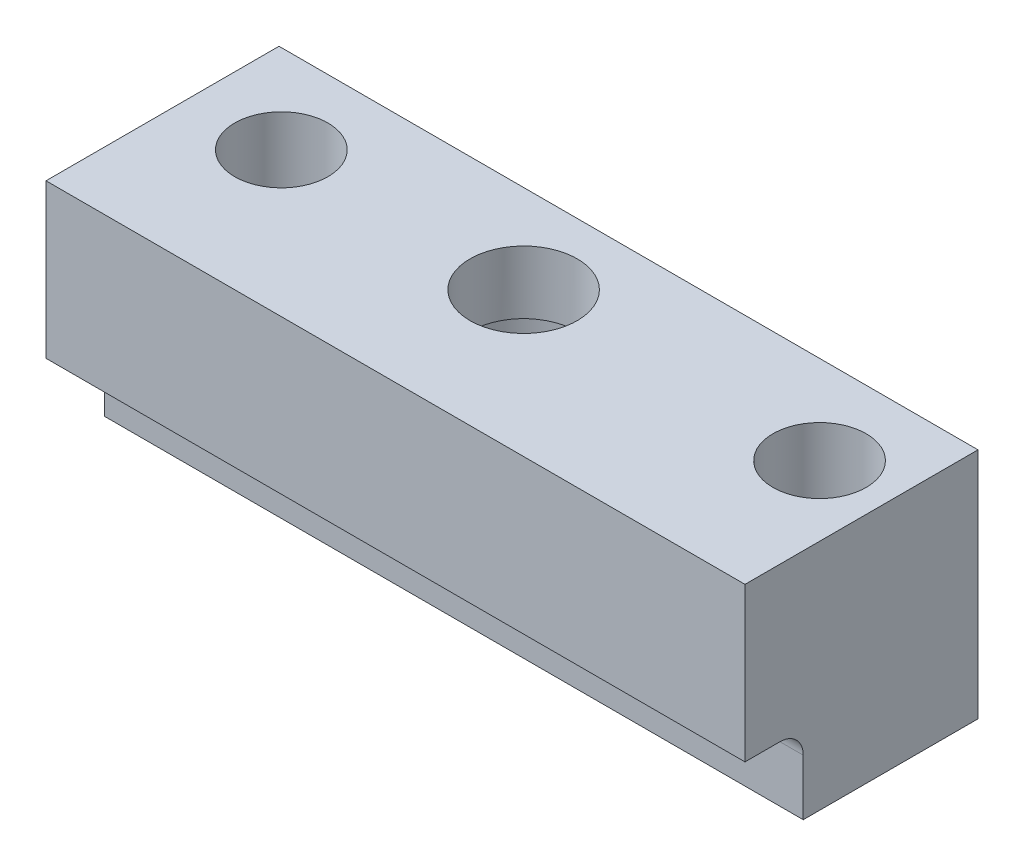
ISO-10303-21;
HEADER;
FILE_DESCRIPTION(('STEP AP214'),'2;1');
FILE_NAME('part.step','',(''),(''),'','','');
FILE_SCHEMA(('AUTOMOTIVE_DESIGN { 1 0 10303 214 1 1 1 1 }'));
ENDSEC;
DATA;
#1=APPLICATION_CONTEXT('core data for automotive mechanical design processes');
#2=APPLICATION_PROTOCOL_DEFINITION('international standard','automotive_design',2000,#1);
#3=PRODUCT_CONTEXT('',#1,'mechanical');
#4=PRODUCT('Part','Part','',(#3));
#5=PRODUCT_RELATED_PRODUCT_CATEGORY('part','',(#4));
#6=PRODUCT_DEFINITION_FORMATION('','',#4);
#7=PRODUCT_DEFINITION_CONTEXT('part definition',#1,'design');
#8=PRODUCT_DEFINITION('design','',#6,#7);
#9=PRODUCT_DEFINITION_SHAPE('','',#8);
#10=(LENGTH_UNIT() NAMED_UNIT(*) SI_UNIT(.MILLI.,.METRE.));
#11=(NAMED_UNIT(*) PLANE_ANGLE_UNIT() SI_UNIT($,.RADIAN.));
#12=(NAMED_UNIT(*) SI_UNIT($,.STERADIAN.) SOLID_ANGLE_UNIT());
#13=UNCERTAINTY_MEASURE_WITH_UNIT(LENGTH_MEASURE(1.E-05),#10,'distance_accuracy_value','');
#14=(GEOMETRIC_REPRESENTATION_CONTEXT(3) GLOBAL_UNCERTAINTY_ASSIGNED_CONTEXT((#13)) GLOBAL_UNIT_ASSIGNED_CONTEXT((#10,
#11,#12)) REPRESENTATION_CONTEXT('',''));
#15=CARTESIAN_POINT('',(0.,0.,0.));
#16=DIRECTION('',(0.,0.,1.));
#17=DIRECTION('',(1.,0.,0.));
#18=AXIS2_PLACEMENT_3D('',#15,#16,#17);
#19=CARTESIAN_POINT('',(0.,-8.636,-9.398));
#20=DIRECTION('',(0.,1.,0.));
#21=DIRECTION('',(0.,0.,1.));
#22=AXIS2_PLACEMENT_3D('',#19,#20,#21);
#23=CYLINDRICAL_SURFACE('',#22,5.842);
#24=CARTESIAN_POINT('',(0.,16.764,-9.398));
#25=DIRECTION('',(0.,1.,0.));
#26=DIRECTION('',(0.,0.,1.));
#27=AXIS2_PLACEMENT_3D('',#24,#25,#26);
#28=CIRCLE('',#27,5.842);
#29=CARTESIAN_POINT('',(0.,16.764,-3.556));
#30=VERTEX_POINT('',#29);
#31=EDGE_CURVE('E217',#30,#30,#28,.T.);
#32=ORIENTED_EDGE('',*,*,#31,.T.);
#33=EDGE_LOOP('',(#32));
#34=FACE_BOUND('',#33,.T.);
#35=CARTESIAN_POINT('',(0.,9.906,-9.398));
#36=DIRECTION('',(0.,-1.,0.));
#37=DIRECTION('',(0.,0.,-1.));
#38=AXIS2_PLACEMENT_3D('',#35,#36,#37);
#39=CIRCLE('',#38,5.842);
#40=CARTESIAN_POINT('',(0.,9.906,-15.24));
#41=VERTEX_POINT('',#40);
#42=EDGE_CURVE('E37',#41,#41,#39,.F.);
#43=ORIENTED_EDGE('',*,*,#42,.F.);
#44=EDGE_LOOP('',(#43));
#45=FACE_BOUND('',#44,.T.);
#46=ADVANCED_FACE('F33',(#34,#45),#23,.F.);
#47=CARTESIAN_POINT('',(-36.322,-8.636,0.));
#48=DIRECTION('',(0.,0.,1.));
#49=DIRECTION('',(1.,0.,0.));
#50=AXIS2_PLACEMENT_3D('',#47,#48,#49);
#51=PLANE('',#50);
#52=DIRECTION('',(0.,-1.,0.));
#53=VECTOR('',#52,1.);
#54=CARTESIAN_POINT('',(39.878,-8.636,0.));
#55=LINE('',#54,#53);
#56=CARTESIAN_POINT('',(39.878,-2.54,0.));
#57=VERTEX_POINT('',#56);
#58=CARTESIAN_POINT('',(39.878,-8.636,0.));
#59=VERTEX_POINT('',#58);
#60=EDGE_CURVE('E89',#57,#59,#55,.T.);
#61=ORIENTED_EDGE('',*,*,#60,.F.);
#62=DIRECTION('',(1.,0.,0.));
#63=VECTOR('',#62,1.);
#64=CARTESIAN_POINT('',(-36.322,-2.54,0.));
#65=LINE('',#64,#63);
#66=CARTESIAN_POINT('',(-36.322,-2.54,0.));
#67=VERTEX_POINT('',#66);
#68=EDGE_CURVE('E49',#57,#67,#65,.F.);
#69=ORIENTED_EDGE('',*,*,#68,.T.);
#70=DIRECTION('',(0.,-1.,0.));
#71=VECTOR('',#70,1.);
#72=CARTESIAN_POINT('',(-36.322,-8.636,0.));
#73=LINE('',#72,#71);
#74=CARTESIAN_POINT('',(-36.322,-8.636,0.));
#75=VERTEX_POINT('',#74);
#76=EDGE_CURVE('E101',#67,#75,#73,.T.);
#77=ORIENTED_EDGE('',*,*,#76,.T.);
#78=DIRECTION('',(1.,0.,0.));
#79=VECTOR('',#78,1.);
#80=CARTESIAN_POINT('',(-36.322,-8.636,0.));
#81=LINE('',#80,#79);
#82=EDGE_CURVE('E99',#75,#59,#81,.T.);
#83=ORIENTED_EDGE('',*,*,#82,.T.);
#84=EDGE_LOOP('',(#61,#69,#77,#83));
#85=FACE_BOUND('',#84,.T.);
#86=ADVANCED_FACE('F100',(#85),#51,.T.);
#87=CARTESIAN_POINT('',(-36.322,0.,0.));
#88=DIRECTION('',(0.,-1.,0.));
#89=DIRECTION('',(0.,0.,-1.));
#90=AXIS2_PLACEMENT_3D('',#87,#88,#89);
#91=PLANE('',#90);
#92=DIRECTION('',(0.,0.,-1.));
#93=VECTOR('',#92,1.);
#94=CARTESIAN_POINT('',(-36.322,0.,0.));
#95=LINE('',#94,#93);
#96=CARTESIAN_POINT('',(-36.322,0.,6.35));
#97=VERTEX_POINT('',#96);
#98=CARTESIAN_POINT('',(-36.322,0.,2.54));
#99=VERTEX_POINT('',#98);
#100=EDGE_CURVE('E106',#97,#99,#95,.T.);
#101=ORIENTED_EDGE('',*,*,#100,.T.);
#102=DIRECTION('',(1.,0.,0.));
#103=VECTOR('',#102,1.);
#104=CARTESIAN_POINT('',(39.878,0.,2.54));
#105=LINE('',#104,#103);
#106=CARTESIAN_POINT('',(39.878,0.,2.54));
#107=VERTEX_POINT('',#106);
#108=EDGE_CURVE('E138',#99,#107,#105,.T.);
#109=ORIENTED_EDGE('',*,*,#108,.T.);
#110=DIRECTION('',(0.,0.,-1.));
#111=VECTOR('',#110,1.);
#112=CARTESIAN_POINT('',(39.878,0.,0.));
#113=LINE('',#112,#111);
#114=CARTESIAN_POINT('',(39.878,0.,6.35));
#115=VERTEX_POINT('',#114);
#116=EDGE_CURVE('E120',#115,#107,#113,.T.);
#117=ORIENTED_EDGE('',*,*,#116,.F.);
#118=DIRECTION('',(1.,0.,0.));
#119=VECTOR('',#118,1.);
#120=CARTESIAN_POINT('',(-36.322,0.,6.35));
#121=LINE('',#120,#119);
#122=EDGE_CURVE('E136',#97,#115,#121,.T.);
#123=ORIENTED_EDGE('',*,*,#122,.F.);
#124=EDGE_LOOP('',(#101,#109,#117,#123));
#125=FACE_BOUND('',#124,.T.);
#126=ADVANCED_FACE('F150',(#125),#91,.T.);
#127=CARTESIAN_POINT('',(-36.322,0.,6.35));
#128=DIRECTION('',(0.,0.,1.));
#129=DIRECTION('',(1.,0.,0.));
#130=AXIS2_PLACEMENT_3D('',#127,#128,#129);
#131=PLANE('',#130);
#132=ORIENTED_EDGE('',*,*,#122,.T.);
#133=DIRECTION('',(0.,-1.,0.));
#134=VECTOR('',#133,1.);
#135=CARTESIAN_POINT('',(39.878,0.,6.35));
#136=LINE('',#135,#134);
#137=CARTESIAN_POINT('',(39.878,16.764,6.35));
#138=VERTEX_POINT('',#137);
#139=EDGE_CURVE('E117',#138,#115,#136,.T.);
#140=ORIENTED_EDGE('',*,*,#139,.F.);
#141=DIRECTION('',(1.,0.,0.));
#142=VECTOR('',#141,1.);
#143=CARTESIAN_POINT('',(-36.322,16.764,6.35));
#144=LINE('',#143,#142);
#145=CARTESIAN_POINT('',(-36.322,16.764,6.35));
#146=VERTEX_POINT('',#145);
#147=EDGE_CURVE('E139',#146,#138,#144,.T.);
#148=ORIENTED_EDGE('',*,*,#147,.F.);
#149=DIRECTION('',(0.,-1.,0.));
#150=VECTOR('',#149,1.);
#151=CARTESIAN_POINT('',(-36.322,0.,6.35));
#152=LINE('',#151,#150);
#153=EDGE_CURVE('E131',#146,#97,#152,.T.);
#154=ORIENTED_EDGE('',*,*,#153,.T.);
#155=EDGE_LOOP('',(#132,#140,#148,#154));
#156=FACE_BOUND('',#155,.T.);
#157=ADVANCED_FACE('F157',(#156),#131,.T.);
#158=CARTESIAN_POINT('',(-36.322,16.764,6.35));
#159=DIRECTION('',(0.,1.,0.));
#160=DIRECTION('',(0.,0.,1.));
#161=AXIS2_PLACEMENT_3D('',#158,#159,#160);
#162=PLANE('',#161);
#163=CARTESIAN_POINT('',(32.258,16.764,-9.398));
#164=DIRECTION('',(0.,1.,0.));
#165=DIRECTION('',(0.,0.,1.));
#166=AXIS2_PLACEMENT_3D('',#163,#164,#165);
#167=CIRCLE('',#166,5.08000000000001);
#168=CARTESIAN_POINT('',(32.258,16.764,-4.31799999999999));
#169=VERTEX_POINT('',#168);
#170=EDGE_CURVE('E219',#169,#169,#167,.T.);
#171=ORIENTED_EDGE('',*,*,#170,.F.);
#172=EDGE_LOOP('',(#171));
#173=FACE_BOUND('',#172,.T.);
#174=ORIENTED_EDGE('',*,*,#31,.F.);
#175=EDGE_LOOP('',(#174));
#176=FACE_BOUND('',#175,.T.);
#177=CARTESIAN_POINT('',(-26.416,16.764,-9.398));
#178=DIRECTION('',(0.,1.,0.));
#179=DIRECTION('',(0.,0.,1.));
#180=AXIS2_PLACEMENT_3D('',#177,#178,#179);
#181=CIRCLE('',#180,5.08);
#182=CARTESIAN_POINT('',(-26.416,16.764,-4.318));
#183=VERTEX_POINT('',#182);
#184=EDGE_CURVE('E213',#183,#183,#181,.T.);
#185=ORIENTED_EDGE('',*,*,#184,.F.);
#186=EDGE_LOOP('',(#185));
#187=FACE_BOUND('',#186,.T.);
#188=ORIENTED_EDGE('',*,*,#147,.T.);
#189=DIRECTION('',(0.,0.,1.));
#190=VECTOR('',#189,1.);
#191=CARTESIAN_POINT('',(39.878,16.764,6.35));
#192=LINE('',#191,#190);
#193=CARTESIAN_POINT('',(39.878,16.764,-19.05));
#194=VERTEX_POINT('',#193);
#195=EDGE_CURVE('E111',#194,#138,#192,.T.);
#196=ORIENTED_EDGE('',*,*,#195,.F.);
#197=DIRECTION('',(1.,0.,0.));
#198=VECTOR('',#197,1.);
#199=CARTESIAN_POINT('',(-36.322,16.764,-19.05));
#200=LINE('',#199,#198);
#201=CARTESIAN_POINT('',(-36.322,16.764,-19.05));
#202=VERTEX_POINT('',#201);
#203=EDGE_CURVE('E141',#202,#194,#200,.T.);
#204=ORIENTED_EDGE('',*,*,#203,.F.);
#205=DIRECTION('',(0.,0.,1.));
#206=VECTOR('',#205,1.);
#207=CARTESIAN_POINT('',(-36.322,16.764,6.35));
#208=LINE('',#207,#206);
#209=EDGE_CURVE('E128',#202,#146,#208,.T.);
#210=ORIENTED_EDGE('',*,*,#209,.T.);
#211=EDGE_LOOP('',(#188,#196,#204,#210));
#212=FACE_BOUND('',#211,.T.);
#213=ADVANCED_FACE('F191',(#173,#176,#187,#212),#162,.T.);
#214=CARTESIAN_POINT('',(-36.322,16.764,-19.05));
#215=DIRECTION('',(0.,0.,-1.));
#216=DIRECTION('',(0.,1.,0.));
#217=AXIS2_PLACEMENT_3D('',#214,#215,#216);
#218=PLANE('',#217);
#219=ORIENTED_EDGE('',*,*,#203,.T.);
#220=DIRECTION('',(0.,1.,0.));
#221=VECTOR('',#220,1.);
#222=CARTESIAN_POINT('',(39.878,16.764,-19.05));
#223=LINE('',#222,#221);
#224=CARTESIAN_POINT('',(39.878,-8.636,-19.05));
#225=VERTEX_POINT('',#224);
#226=EDGE_CURVE('E109',#225,#194,#223,.T.);
#227=ORIENTED_EDGE('',*,*,#226,.F.);
#228=DIRECTION('',(1.,0.,0.));
#229=VECTOR('',#228,1.);
#230=CARTESIAN_POINT('',(-36.322,-8.636,-19.05));
#231=LINE('',#230,#229);
#232=CARTESIAN_POINT('',(-36.322,-8.636,-19.05));
#233=VERTEX_POINT('',#232);
#234=EDGE_CURVE('E105',#233,#225,#231,.T.);
#235=ORIENTED_EDGE('',*,*,#234,.F.);
#236=DIRECTION('',(0.,1.,0.));
#237=VECTOR('',#236,1.);
#238=CARTESIAN_POINT('',(-36.322,16.764,-19.05));
#239=LINE('',#238,#237);
#240=EDGE_CURVE('E125',#233,#202,#239,.T.);
#241=ORIENTED_EDGE('',*,*,#240,.T.);
#242=EDGE_LOOP('',(#219,#227,#235,#241));
#243=FACE_BOUND('',#242,.T.);
#244=ADVANCED_FACE('F194',(#243),#218,.T.);
#245=CARTESIAN_POINT('',(-36.322,-8.636,-19.05));
#246=DIRECTION('',(0.,-1.,0.));
#247=DIRECTION('',(0.,0.,-1.));
#248=AXIS2_PLACEMENT_3D('',#245,#246,#247);
#249=PLANE('',#248);
#250=CARTESIAN_POINT('',(0.,-8.636,-9.398));
#251=DIRECTION('',(0.,-1.,0.));
#252=DIRECTION('',(0.,0.,-1.));
#253=AXIS2_PLACEMENT_3D('',#250,#251,#252);
#254=CIRCLE('',#253,7.366);
#255=CARTESIAN_POINT('',(0.,-8.636,-16.764));
#256=VERTEX_POINT('',#255);
#257=EDGE_CURVE('E206',#256,#256,#254,.T.);
#258=ORIENTED_EDGE('',*,*,#257,.F.);
#259=EDGE_LOOP('',(#258));
#260=FACE_BOUND('',#259,.T.);
#261=CARTESIAN_POINT('',(32.258,-8.636,-9.398));
#262=DIRECTION('',(0.,1.,0.));
#263=DIRECTION('',(0.,0.,1.));
#264=AXIS2_PLACEMENT_3D('',#261,#262,#263);
#265=CIRCLE('',#264,5.08000000000001);
#266=CARTESIAN_POINT('',(32.258,-8.636,-4.31799999999999));
#267=VERTEX_POINT('',#266);
#268=EDGE_CURVE('E210',#267,#267,#265,.T.);
#269=ORIENTED_EDGE('',*,*,#268,.T.);
#270=EDGE_LOOP('',(#269));
#271=FACE_BOUND('',#270,.T.);
#272=CARTESIAN_POINT('',(-26.416,-8.636,-9.398));
#273=DIRECTION('',(0.,1.,0.));
#274=DIRECTION('',(0.,0.,1.));
#275=AXIS2_PLACEMENT_3D('',#272,#273,#274);
#276=CIRCLE('',#275,5.08);
#277=CARTESIAN_POINT('',(-26.416,-8.636,-4.318));
#278=VERTEX_POINT('',#277);
#279=EDGE_CURVE('E96',#278,#278,#276,.T.);
#280=ORIENTED_EDGE('',*,*,#279,.T.);
#281=EDGE_LOOP('',(#280));
#282=FACE_BOUND('',#281,.T.);
#283=ORIENTED_EDGE('',*,*,#234,.T.);
#284=DIRECTION('',(0.,0.,-1.));
#285=VECTOR('',#284,1.);
#286=CARTESIAN_POINT('',(39.878,-8.636,-19.05));
#287=LINE('',#286,#285);
#288=EDGE_CURVE('E94',#59,#225,#287,.T.);
#289=ORIENTED_EDGE('',*,*,#288,.F.);
#290=ORIENTED_EDGE('',*,*,#82,.F.);
#291=DIRECTION('',(0.,0.,-1.));
#292=VECTOR('',#291,1.);
#293=CARTESIAN_POINT('',(-36.322,-8.636,-19.05));
#294=LINE('',#293,#292);
#295=EDGE_CURVE('E123',#75,#233,#294,.T.);
#296=ORIENTED_EDGE('',*,*,#295,.T.);
#297=EDGE_LOOP('',(#283,#289,#290,#296));
#298=FACE_BOUND('',#297,.T.);
#299=ADVANCED_FACE('F108',(#260,#271,#282,#298),#249,.T.);
#300=CARTESIAN_POINT('',(-36.322,0.,0.));
#301=DIRECTION('',(1.,0.,0.));
#302=DIRECTION('',(0.,0.,-1.));
#303=AXIS2_PLACEMENT_3D('',#300,#301,#302);
#304=PLANE('',#303);
#305=ORIENTED_EDGE('',*,*,#76,.F.);
#306=CARTESIAN_POINT('',(-36.322,-2.54,2.54));
#307=DIRECTION('',(1.,0.,0.));
#308=DIRECTION('',(0.,0.,-1.));
#309=AXIS2_PLACEMENT_3D('',#306,#307,#308);
#310=CIRCLE('',#309,2.54);
#311=EDGE_CURVE('E11',#67,#99,#310,.T.);
#312=ORIENTED_EDGE('',*,*,#311,.T.);
#313=ORIENTED_EDGE('',*,*,#100,.F.);
#314=ORIENTED_EDGE('',*,*,#153,.F.);
#315=ORIENTED_EDGE('',*,*,#209,.F.);
#316=ORIENTED_EDGE('',*,*,#240,.F.);
#317=ORIENTED_EDGE('',*,*,#295,.F.);
#318=EDGE_LOOP('',(#305,#312,#313,#314,#315,#316,#317));
#319=FACE_BOUND('',#318,.T.);
#320=ADVANCED_FACE('F161',(#319),#304,.F.);
#321=CARTESIAN_POINT('',(39.878,0.,0.));
#322=DIRECTION('',(1.,0.,0.));
#323=DIRECTION('',(0.,0.,-1.));
#324=AXIS2_PLACEMENT_3D('',#321,#322,#323);
#325=PLANE('',#324);
#326=ORIENTED_EDGE('',*,*,#116,.T.);
#327=CARTESIAN_POINT('',(39.878,-2.54,2.54));
#328=DIRECTION('',(1.,0.,0.));
#329=DIRECTION('',(0.,0.,-1.));
#330=AXIS2_PLACEMENT_3D('',#327,#328,#329);
#331=CIRCLE('',#330,2.54);
#332=EDGE_CURVE('E42',#107,#57,#331,.F.);
#333=ORIENTED_EDGE('',*,*,#332,.T.);
#334=ORIENTED_EDGE('',*,*,#60,.T.);
#335=ORIENTED_EDGE('',*,*,#288,.T.);
#336=ORIENTED_EDGE('',*,*,#226,.T.);
#337=ORIENTED_EDGE('',*,*,#195,.T.);
#338=ORIENTED_EDGE('',*,*,#139,.T.);
#339=EDGE_LOOP('',(#326,#333,#334,#335,#336,#337,#338));
#340=FACE_BOUND('',#339,.T.);
#341=ADVANCED_FACE('F91',(#340),#325,.T.);
#342=CARTESIAN_POINT('',(-36.322,-2.54,2.54));
#343=DIRECTION('',(-1.,0.,0.));
#344=DIRECTION('',(0.,0.,1.));
#345=AXIS2_PLACEMENT_3D('',#342,#343,#344);
#346=CYLINDRICAL_SURFACE('',#345,2.54);
#347=ORIENTED_EDGE('',*,*,#311,.F.);
#348=ORIENTED_EDGE('',*,*,#68,.F.);
#349=ORIENTED_EDGE('',*,*,#332,.F.);
#350=ORIENTED_EDGE('',*,*,#108,.F.);
#351=EDGE_LOOP('',(#347,#348,#349,#350));
#352=FACE_BOUND('',#351,.T.);
#353=ADVANCED_FACE('F35',(#352),#346,.F.);
#354=CARTESIAN_POINT('',(-26.416,-8.636,-9.398));
#355=DIRECTION('',(0.,1.,0.));
#356=DIRECTION('',(0.,0.,1.));
#357=AXIS2_PLACEMENT_3D('',#354,#355,#356);
#358=CYLINDRICAL_SURFACE('',#357,5.08);
#359=ORIENTED_EDGE('',*,*,#279,.F.);
#360=EDGE_LOOP('',(#359));
#361=FACE_BOUND('',#360,.T.);
#362=ORIENTED_EDGE('',*,*,#184,.T.);
#363=EDGE_LOOP('',(#362));
#364=FACE_BOUND('',#363,.T.);
#365=ADVANCED_FACE('F163',(#361,#364),#358,.F.);
#366=CARTESIAN_POINT('',(32.258,-8.636,-9.398));
#367=DIRECTION('',(0.,1.,0.));
#368=DIRECTION('',(0.,0.,1.));
#369=AXIS2_PLACEMENT_3D('',#366,#367,#368);
#370=CYLINDRICAL_SURFACE('',#369,5.08000000000001);
#371=ORIENTED_EDGE('',*,*,#268,.F.);
#372=EDGE_LOOP('',(#371));
#373=FACE_BOUND('',#372,.T.);
#374=ORIENTED_EDGE('',*,*,#170,.T.);
#375=EDGE_LOOP('',(#374));
#376=FACE_BOUND('',#375,.T.);
#377=ADVANCED_FACE('F168',(#373,#376),#370,.F.);
#378=CARTESIAN_POINT('',(0.,9.906,-9.398));
#379=DIRECTION('',(0.,-1.,0.));
#380=DIRECTION('',(0.,0.,-1.));
#381=AXIS2_PLACEMENT_3D('',#378,#379,#380);
#382=PLANE('',#381);
#383=CARTESIAN_POINT('',(0.,9.906,-9.398));
#384=DIRECTION('',(0.,-1.,0.));
#385=DIRECTION('',(0.,0.,-1.));
#386=AXIS2_PLACEMENT_3D('',#383,#384,#385);
#387=CIRCLE('',#386,7.366);
#388=CARTESIAN_POINT('',(0.,9.906,-16.764));
#389=VERTEX_POINT('',#388);
#390=EDGE_CURVE('E224',#389,#389,#387,.T.);
#391=ORIENTED_EDGE('',*,*,#390,.T.);
#392=EDGE_LOOP('',(#391));
#393=FACE_BOUND('',#392,.T.);
#394=ORIENTED_EDGE('',*,*,#42,.T.);
#395=EDGE_LOOP('',(#394));
#396=FACE_BOUND('',#395,.T.);
#397=ADVANCED_FACE('F231',(#393,#396),#382,.T.);
#398=CARTESIAN_POINT('',(0.,9.906,-9.398));
#399=DIRECTION('',(0.,-1.,0.));
#400=DIRECTION('',(0.,0.,-1.));
#401=AXIS2_PLACEMENT_3D('',#398,#399,#400);
#402=CYLINDRICAL_SURFACE('',#401,7.366);
#403=ORIENTED_EDGE('',*,*,#390,.F.);
#404=EDGE_LOOP('',(#403));
#405=FACE_BOUND('',#404,.T.);
#406=ORIENTED_EDGE('',*,*,#257,.T.);
#407=EDGE_LOOP('',(#406));
#408=FACE_BOUND('',#407,.T.);
#409=ADVANCED_FACE('F233',(#405,#408),#402,.F.);
#410=CLOSED_SHELL('',(#46,#86,#126,#157,#213,#244,#299,#320,#341,#353,#365,#377,#397,#409));
#411=MANIFOLD_SOLID_BREP('B2',#410);
#412=ADVANCED_BREP_SHAPE_REPRESENTATION('',(#18,#411),#14);
#413=SHAPE_DEFINITION_REPRESENTATION(#9,#412);
ENDSEC;
END-ISO-10303-21;
